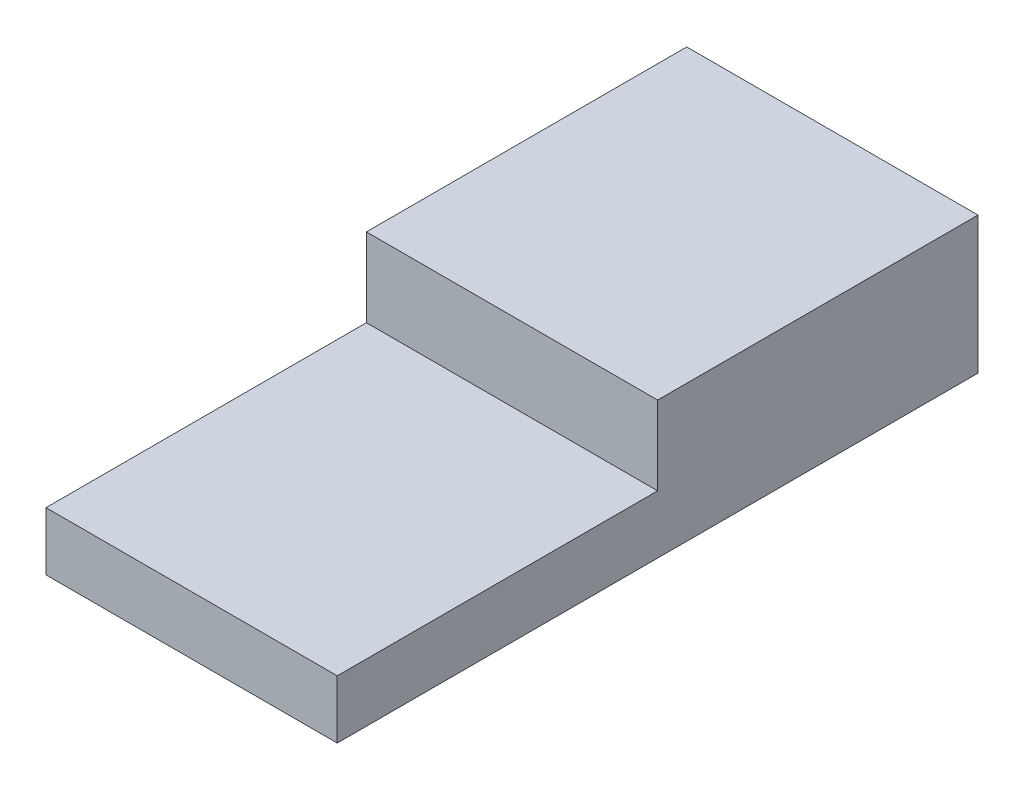
ISO-10303-21;
HEADER;
FILE_DESCRIPTION(('STEP AP214'),'2;1');
FILE_NAME('part.step','',(''),(''),'','','');
FILE_SCHEMA(('AUTOMOTIVE_DESIGN { 1 0 10303 214 1 1 1 1 }'));
ENDSEC;
DATA;
#1=APPLICATION_CONTEXT('core data for automotive mechanical design processes');
#2=APPLICATION_PROTOCOL_DEFINITION('international standard','automotive_design',2000,#1);
#3=PRODUCT_CONTEXT('',#1,'mechanical');
#4=PRODUCT('Part','Part','',(#3));
#5=PRODUCT_RELATED_PRODUCT_CATEGORY('part','',(#4));
#6=PRODUCT_DEFINITION_FORMATION('','',#4);
#7=PRODUCT_DEFINITION_CONTEXT('part definition',#1,'design');
#8=PRODUCT_DEFINITION('design','',#6,#7);
#9=PRODUCT_DEFINITION_SHAPE('','',#8);
#10=(LENGTH_UNIT() NAMED_UNIT(*) SI_UNIT(.MILLI.,.METRE.));
#11=(NAMED_UNIT(*) PLANE_ANGLE_UNIT() SI_UNIT($,.RADIAN.));
#12=(NAMED_UNIT(*) SI_UNIT($,.STERADIAN.) SOLID_ANGLE_UNIT());
#13=UNCERTAINTY_MEASURE_WITH_UNIT(LENGTH_MEASURE(1.E-05),#10,'distance_accuracy_value','');
#14=(GEOMETRIC_REPRESENTATION_CONTEXT(3) GLOBAL_UNCERTAINTY_ASSIGNED_CONTEXT((#13)) GLOBAL_UNIT_ASSIGNED_CONTEXT((#10,
#11,#12)) REPRESENTATION_CONTEXT('',''));
#15=CARTESIAN_POINT('',(0.,0.,0.));
#16=DIRECTION('',(0.,0.,1.));
#17=DIRECTION('',(1.,0.,0.));
#18=AXIS2_PLACEMENT_3D('',#15,#16,#17);
#19=CARTESIAN_POINT('',(-17.849765258216,2.,-2.53051643192488));
#20=DIRECTION('',(1.,0.,0.));
#21=DIRECTION('',(0.,0.,-1.));
#22=AXIS2_PLACEMENT_3D('',#19,#20,#21);
#23=PLANE('',#22);
#24=CARTESIAN_POINT('',(-17.849765258216,2.3,3.36948356807512));
#25=DIRECTION('',(-1.,0.,0.));
#26=DIRECTION('',(0.,0.,1.));
#27=AXIS2_PLACEMENT_3D('',#24,#25,#26);
#28=CIRCLE('',#27,1.);
#29=CARTESIAN_POINT('',(-17.849765258216,2.3,4.36948356807512));
#30=VERTEX_POINT('',#29);
#31=EDGE_CURVE('E157',#30,#30,#28,.T.);
#32=ORIENTED_EDGE('',*,*,#31,.F.);
#33=EDGE_LOOP('',(#32));
#34=FACE_BOUND('',#33,.T.);
#35=DIRECTION('',(0.,0.,1.));
#36=VECTOR('',#35,1.);
#37=CARTESIAN_POINT('',(-17.849765258216,0.,-2.53051643192488));
#38=LINE('',#37,#36);
#39=CARTESIAN_POINT('',(-17.849765258216,0.,-2.53051643192488));
#40=VERTEX_POINT('',#39);
#41=CARTESIAN_POINT('',(-17.8497652582159,0.,19.4694835680751));
#42=VERTEX_POINT('',#41);
#43=EDGE_CURVE('E99',#40,#42,#38,.T.);
#44=ORIENTED_EDGE('',*,*,#43,.T.);
#45=DIRECTION('',(0.,-1.,0.));
#46=VECTOR('',#45,1.);
#47=CARTESIAN_POINT('',(-17.8497652582159,2.,19.4694835680751));
#48=LINE('',#47,#46);
#49=CARTESIAN_POINT('',(-17.8497652582159,2.,19.4694835680751));
#50=VERTEX_POINT('',#49);
#51=EDGE_CURVE('E11',#50,#42,#48,.T.);
#52=ORIENTED_EDGE('',*,*,#51,.F.);
#53=DIRECTION('',(0.,0.,1.));
#54=VECTOR('',#53,1.);
#55=CARTESIAN_POINT('',(-17.849765258216,2.,-2.53051643192488));
#56=LINE('',#55,#54);
#57=CARTESIAN_POINT('',(-17.849765258216,2.,8.46948356807512));
#58=VERTEX_POINT('',#57);
#59=EDGE_CURVE('E92',#58,#50,#56,.T.);
#60=ORIENTED_EDGE('',*,*,#59,.F.);
#61=DIRECTION('',(0.,-1.,0.));
#62=VECTOR('',#61,1.);
#63=CARTESIAN_POINT('',(-17.849765258216,4.7,8.46948356807512));
#64=LINE('',#63,#62);
#65=CARTESIAN_POINT('',(-17.849765258216,4.7,8.46948356807512));
#66=VERTEX_POINT('',#65);
#67=EDGE_CURVE('E109',#66,#58,#64,.T.);
#68=ORIENTED_EDGE('',*,*,#67,.F.);
#69=DIRECTION('',(0.,0.,1.));
#70=VECTOR('',#69,1.);
#71=CARTESIAN_POINT('',(-17.849765258216,4.7,-2.53051643192488));
#72=LINE('',#71,#70);
#73=CARTESIAN_POINT('',(-17.849765258216,4.7,-2.53051643192488));
#74=VERTEX_POINT('',#73);
#75=EDGE_CURVE('E102',#74,#66,#72,.T.);
#76=ORIENTED_EDGE('',*,*,#75,.F.);
#77=DIRECTION('',(0.,-1.,0.));
#78=VECTOR('',#77,1.);
#79=CARTESIAN_POINT('',(-17.849765258216,2.,-2.53051643192488));
#80=LINE('',#79,#78);
#81=EDGE_CURVE('E84',#74,#40,#80,.T.);
#82=ORIENTED_EDGE('',*,*,#81,.T.);
#83=EDGE_LOOP('',(#44,#52,#60,#68,#76,#82));
#84=FACE_BOUND('',#83,.T.);
#85=ADVANCED_FACE('F39',(#34,#84),#23,.F.);
#86=CARTESIAN_POINT('',(-17.8497652582159,2.,19.4694835680751));
#87=DIRECTION('',(0.,0.,-1.));
#88=DIRECTION('',(-1.,0.,0.));
#89=AXIS2_PLACEMENT_3D('',#86,#87,#88);
#90=PLANE('',#89);
#91=DIRECTION('',(1.,0.,0.));
#92=VECTOR('',#91,1.);
#93=CARTESIAN_POINT('',(-17.8497652582159,0.,19.4694835680751));
#94=LINE('',#93,#92);
#95=CARTESIAN_POINT('',(-7.84976525821595,0.,19.4694835680751));
#96=VERTEX_POINT('',#95);
#97=EDGE_CURVE('E107',#42,#96,#94,.T.);
#98=ORIENTED_EDGE('',*,*,#97,.T.);
#99=DIRECTION('',(0.,-1.,0.));
#100=VECTOR('',#99,1.);
#101=CARTESIAN_POINT('',(-7.84976525821595,2.,19.4694835680751));
#102=LINE('',#101,#100);
#103=CARTESIAN_POINT('',(-7.84976525821595,2.,19.4694835680751));
#104=VERTEX_POINT('',#103);
#105=EDGE_CURVE('E47',#104,#96,#102,.T.);
#106=ORIENTED_EDGE('',*,*,#105,.F.);
#107=DIRECTION('',(1.,0.,0.));
#108=VECTOR('',#107,1.);
#109=CARTESIAN_POINT('',(-17.8497652582159,2.,19.4694835680751));
#110=LINE('',#109,#108);
#111=EDGE_CURVE('E60',#50,#104,#110,.T.);
#112=ORIENTED_EDGE('',*,*,#111,.F.);
#113=ORIENTED_EDGE('',*,*,#51,.T.);
#114=EDGE_LOOP('',(#98,#106,#112,#113));
#115=FACE_BOUND('',#114,.T.);
#116=ADVANCED_FACE('F130',(#115),#90,.F.);
#117=CARTESIAN_POINT('',(-7.84976525821595,2.,-2.53051643192488));
#118=DIRECTION('',(-1.,0.,0.));
#119=DIRECTION('',(0.,0.,1.));
#120=AXIS2_PLACEMENT_3D('',#117,#118,#119);
#121=PLANE('',#120);
#122=DIRECTION('',(0.,0.,-1.));
#123=VECTOR('',#122,1.);
#124=CARTESIAN_POINT('',(-7.84976525821595,0.,-2.53051643192488));
#125=LINE('',#124,#123);
#126=CARTESIAN_POINT('',(-7.84976525821595,0.,-2.53051643192488));
#127=VERTEX_POINT('',#126);
#128=EDGE_CURVE('E93',#96,#127,#125,.T.);
#129=ORIENTED_EDGE('',*,*,#128,.T.);
#130=DIRECTION('',(0.,-1.,0.));
#131=VECTOR('',#130,1.);
#132=CARTESIAN_POINT('',(-7.84976525821595,2.,-2.53051643192488));
#133=LINE('',#132,#131);
#134=CARTESIAN_POINT('',(-7.84976525821595,4.7,-2.53051643192488));
#135=VERTEX_POINT('',#134);
#136=EDGE_CURVE('E87',#135,#127,#133,.T.);
#137=ORIENTED_EDGE('',*,*,#136,.F.);
#138=DIRECTION('',(0.,0.,-1.));
#139=VECTOR('',#138,1.);
#140=CARTESIAN_POINT('',(-7.84976525821595,4.7,-2.53051643192488));
#141=LINE('',#140,#139);
#142=CARTESIAN_POINT('',(-7.84976525821595,4.7,8.46948356807512));
#143=VERTEX_POINT('',#142);
#144=EDGE_CURVE('E147',#143,#135,#141,.T.);
#145=ORIENTED_EDGE('',*,*,#144,.F.);
#146=DIRECTION('',(0.,-1.,0.));
#147=VECTOR('',#146,1.);
#148=CARTESIAN_POINT('',(-7.84976525821595,4.7,8.46948356807512));
#149=LINE('',#148,#147);
#150=CARTESIAN_POINT('',(-7.84976525821595,2.,8.46948356807512));
#151=VERTEX_POINT('',#150);
#152=EDGE_CURVE('E115',#143,#151,#149,.T.);
#153=ORIENTED_EDGE('',*,*,#152,.T.);
#154=DIRECTION('',(0.,0.,-1.));
#155=VECTOR('',#154,1.);
#156=CARTESIAN_POINT('',(-7.84976525821595,2.,-2.53051643192488));
#157=LINE('',#156,#155);
#158=EDGE_CURVE('E104',#104,#151,#157,.T.);
#159=ORIENTED_EDGE('',*,*,#158,.F.);
#160=ORIENTED_EDGE('',*,*,#105,.T.);
#161=EDGE_LOOP('',(#129,#137,#145,#153,#159,#160));
#162=FACE_BOUND('',#161,.T.);
#163=ADVANCED_FACE('F127',(#162),#121,.F.);
#164=CARTESIAN_POINT('',(-17.849765258216,2.,-2.53051643192488));
#165=DIRECTION('',(0.,0.,1.));
#166=DIRECTION('',(1.,0.,0.));
#167=AXIS2_PLACEMENT_3D('',#164,#165,#166);
#168=PLANE('',#167);
#169=DIRECTION('',(-1.,0.,0.));
#170=VECTOR('',#169,1.);
#171=CARTESIAN_POINT('',(-17.849765258216,0.,-2.53051643192488));
#172=LINE('',#171,#170);
#173=EDGE_CURVE('E80',#127,#40,#172,.T.);
#174=ORIENTED_EDGE('',*,*,#173,.T.);
#175=ORIENTED_EDGE('',*,*,#81,.F.);
#176=DIRECTION('',(-1.,0.,0.));
#177=VECTOR('',#176,1.);
#178=CARTESIAN_POINT('',(-17.849765258216,4.7,-2.53051643192488));
#179=LINE('',#178,#177);
#180=EDGE_CURVE('E150',#135,#74,#179,.T.);
#181=ORIENTED_EDGE('',*,*,#180,.F.);
#182=ORIENTED_EDGE('',*,*,#136,.T.);
#183=EDGE_LOOP('',(#174,#175,#181,#182));
#184=FACE_BOUND('',#183,.T.);
#185=ADVANCED_FACE('F82',(#184),#168,.F.);
#186=CARTESIAN_POINT('',(0.,2.,0.));
#187=DIRECTION('',(0.,1.,0.));
#188=DIRECTION('',(0.,0.,1.));
#189=AXIS2_PLACEMENT_3D('',#186,#187,#188);
#190=PLANE('',#189);
#191=DIRECTION('',(1.,0.,0.));
#192=VECTOR('',#191,1.);
#193=CARTESIAN_POINT('',(-17.849765258216,2.,8.46948356807512));
#194=LINE('',#193,#192);
#195=EDGE_CURVE('E54',#58,#151,#194,.T.);
#196=ORIENTED_EDGE('',*,*,#195,.F.);
#197=ORIENTED_EDGE('',*,*,#59,.T.);
#198=ORIENTED_EDGE('',*,*,#111,.T.);
#199=ORIENTED_EDGE('',*,*,#158,.T.);
#200=EDGE_LOOP('',(#196,#197,#198,#199));
#201=FACE_BOUND('',#200,.T.);
#202=ADVANCED_FACE('F167',(#201),#190,.T.);
#203=CARTESIAN_POINT('',(0.,0.,0.));
#204=DIRECTION('',(0.,1.,0.));
#205=DIRECTION('',(0.,0.,1.));
#206=AXIS2_PLACEMENT_3D('',#203,#204,#205);
#207=PLANE('',#206);
#208=ORIENTED_EDGE('',*,*,#43,.F.);
#209=ORIENTED_EDGE('',*,*,#173,.F.);
#210=ORIENTED_EDGE('',*,*,#128,.F.);
#211=ORIENTED_EDGE('',*,*,#97,.F.);
#212=EDGE_LOOP('',(#208,#209,#210,#211));
#213=FACE_BOUND('',#212,.T.);
#214=ADVANCED_FACE('F106',(#213),#207,.F.);
#215=CARTESIAN_POINT('',(-17.849765258216,4.7,8.46948356807512));
#216=DIRECTION('',(0.,0.,-1.));
#217=DIRECTION('',(-1.,0.,0.));
#218=AXIS2_PLACEMENT_3D('',#215,#216,#217);
#219=PLANE('',#218);
#220=ORIENTED_EDGE('',*,*,#195,.T.);
#221=ORIENTED_EDGE('',*,*,#152,.F.);
#222=DIRECTION('',(1.,0.,0.));
#223=VECTOR('',#222,1.);
#224=CARTESIAN_POINT('',(-17.849765258216,4.7,8.46948356807512));
#225=LINE('',#224,#223);
#226=EDGE_CURVE('E140',#66,#143,#225,.T.);
#227=ORIENTED_EDGE('',*,*,#226,.F.);
#228=ORIENTED_EDGE('',*,*,#67,.T.);
#229=EDGE_LOOP('',(#220,#221,#227,#228));
#230=FACE_BOUND('',#229,.T.);
#231=ADVANCED_FACE('F136',(#230),#219,.F.);
#232=CARTESIAN_POINT('',(0.,4.7,0.));
#233=DIRECTION('',(0.,1.,0.));
#234=DIRECTION('',(0.,0.,1.));
#235=AXIS2_PLACEMENT_3D('',#232,#233,#234);
#236=PLANE('',#235);
#237=ORIENTED_EDGE('',*,*,#75,.T.);
#238=ORIENTED_EDGE('',*,*,#226,.T.);
#239=ORIENTED_EDGE('',*,*,#144,.T.);
#240=ORIENTED_EDGE('',*,*,#180,.T.);
#241=EDGE_LOOP('',(#237,#238,#239,#240));
#242=FACE_BOUND('',#241,.T.);
#243=ADVANCED_FACE('F149',(#242),#236,.T.);
#244=CARTESIAN_POINT('',(-15.8497652582159,2.3,3.36948356807512));
#245=DIRECTION('',(-1.,0.,0.));
#246=DIRECTION('',(0.,0.,1.));
#247=AXIS2_PLACEMENT_3D('',#244,#245,#246);
#248=CYLINDRICAL_SURFACE('',#247,1.);
#249=CARTESIAN_POINT('',(-15.8497652582159,2.3,3.36948356807512));
#250=DIRECTION('',(-1.,0.,0.));
#251=DIRECTION('',(0.,0.,1.));
#252=AXIS2_PLACEMENT_3D('',#249,#250,#251);
#253=CIRCLE('',#252,1.);
#254=CARTESIAN_POINT('',(-15.8497652582159,2.3,4.36948356807512));
#255=VERTEX_POINT('',#254);
#256=EDGE_CURVE('E154',#255,#255,#253,.T.);
#257=ORIENTED_EDGE('',*,*,#256,.F.);
#258=EDGE_LOOP('',(#257));
#259=FACE_BOUND('',#258,.T.);
#260=ORIENTED_EDGE('',*,*,#31,.T.);
#261=EDGE_LOOP('',(#260));
#262=FACE_BOUND('',#261,.T.);
#263=ADVANCED_FACE('F196',(#259,#262),#248,.F.);
#264=CARTESIAN_POINT('',(-15.8497652582159,2.3,3.36948356807512));
#265=DIRECTION('',(-1.,0.,0.));
#266=DIRECTION('',(0.,0.,1.));
#267=AXIS2_PLACEMENT_3D('',#264,#265,#266);
#268=PLANE('',#267);
#269=ORIENTED_EDGE('',*,*,#256,.T.);
#270=EDGE_LOOP('',(#269));
#271=FACE_BOUND('',#270,.T.);
#272=ADVANCED_FACE('F194',(#271),#268,.T.);
#273=CLOSED_SHELL('',(#85,#116,#163,#185,#202,#214,#231,#243,#263,#272));
#274=MANIFOLD_SOLID_BREP('B2',#273);
#275=ADVANCED_BREP_SHAPE_REPRESENTATION('',(#18,#274),#14);
#276=SHAPE_DEFINITION_REPRESENTATION(#9,#275);
ENDSEC;
END-ISO-10303-21;
